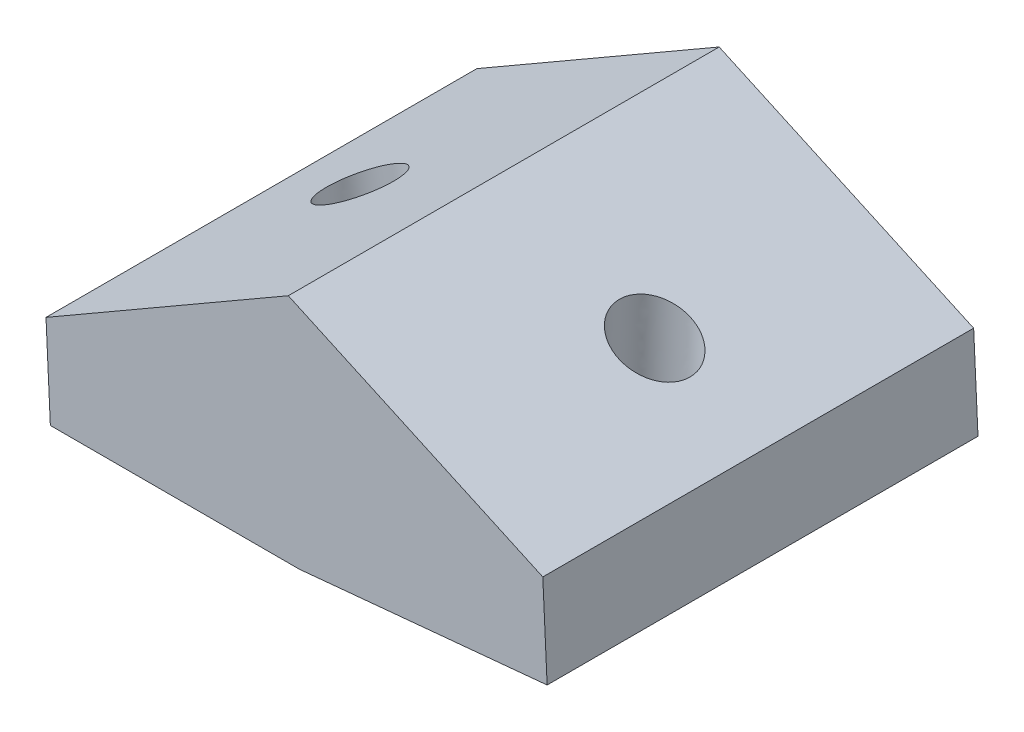
ISO-10303-21;
HEADER;
FILE_DESCRIPTION(('STEP AP214'),'2;1');
FILE_NAME('part.step','',(''),(''),'','','');
FILE_SCHEMA(('AUTOMOTIVE_DESIGN { 1 0 10303 214 1 1 1 1 }'));
ENDSEC;
DATA;
#1=APPLICATION_CONTEXT('core data for automotive mechanical design processes');
#2=APPLICATION_PROTOCOL_DEFINITION('international standard','automotive_design',2000,#1);
#3=PRODUCT_CONTEXT('',#1,'mechanical');
#4=PRODUCT('Part','Part','',(#3));
#5=PRODUCT_RELATED_PRODUCT_CATEGORY('part','',(#4));
#6=PRODUCT_DEFINITION_FORMATION('','',#4);
#7=PRODUCT_DEFINITION_CONTEXT('part definition',#1,'design');
#8=PRODUCT_DEFINITION('design','',#6,#7);
#9=PRODUCT_DEFINITION_SHAPE('','',#8);
#10=(LENGTH_UNIT() NAMED_UNIT(*) SI_UNIT(.MILLI.,.METRE.));
#11=(NAMED_UNIT(*) PLANE_ANGLE_UNIT() SI_UNIT($,.RADIAN.));
#12=(NAMED_UNIT(*) SI_UNIT($,.STERADIAN.) SOLID_ANGLE_UNIT());
#13=UNCERTAINTY_MEASURE_WITH_UNIT(LENGTH_MEASURE(1.E-05),#10,'distance_accuracy_value','');
#14=(GEOMETRIC_REPRESENTATION_CONTEXT(3) GLOBAL_UNCERTAINTY_ASSIGNED_CONTEXT((#13)) GLOBAL_UNIT_ASSIGNED_CONTEXT((#10,
#11,#12)) REPRESENTATION_CONTEXT('',''));
#15=CARTESIAN_POINT('',(0.,0.,0.));
#16=DIRECTION('',(0.,0.,1.));
#17=DIRECTION('',(1.,0.,0.));
#18=AXIS2_PLACEMENT_3D('',#15,#16,#17);
#19=CARTESIAN_POINT('',(10.8020588900131,0.,7.5));
#20=DIRECTION('',(-0.0948474515750241,0.995491818615162,0.));
#21=DIRECTION('',(0.995491818615162,0.0948474515750241,0.));
#22=AXIS2_PLACEMENT_3D('',#19,#20,#21);
#23=PLANE('',#22);
#24=DIRECTION('',(-0.995491818615162,-0.0948474515750241,0.));
#25=VECTOR('',#24,1.);
#26=CARTESIAN_POINT('',(10.8020588900131,0.,-7.5));
#27=LINE('',#26,#25);
#28=CARTESIAN_POINT('',(19.4300978514167,0.822053473746841,-7.5));
#29=VERTEX_POINT('',#28);
#30=CARTESIAN_POINT('',(10.8020588900131,0.,-7.5));
#31=VERTEX_POINT('',#30);
#32=EDGE_CURVE('E117',#29,#31,#27,.T.);
#33=ORIENTED_EDGE('',*,*,#32,.F.);
#34=DIRECTION('',(0.,0.,-1.));
#35=VECTOR('',#34,1.);
#36=CARTESIAN_POINT('',(19.4300978514167,0.822053473746841,7.5));
#37=LINE('',#36,#35);
#38=CARTESIAN_POINT('',(19.4300978514167,0.822053473746841,7.5));
#39=VERTEX_POINT('',#38);
#40=EDGE_CURVE('E114',#39,#29,#37,.T.);
#41=ORIENTED_EDGE('',*,*,#40,.F.);
#42=DIRECTION('',(-0.995491818615162,-0.0948474515750241,0.));
#43=VECTOR('',#42,1.);
#44=CARTESIAN_POINT('',(10.8020588900131,0.,7.5));
#45=LINE('',#44,#43);
#46=CARTESIAN_POINT('',(10.8020588900131,0.,7.5));
#47=VERTEX_POINT('',#46);
#48=EDGE_CURVE('E103',#39,#47,#45,.T.);
#49=ORIENTED_EDGE('',*,*,#48,.T.);
#50=DIRECTION('',(0.,0.,-1.));
#51=VECTOR('',#50,1.);
#52=CARTESIAN_POINT('',(10.8020588900131,0.,7.5));
#53=LINE('',#52,#51);
#54=EDGE_CURVE('E122',#47,#31,#53,.T.);
#55=ORIENTED_EDGE('',*,*,#54,.T.);
#56=EDGE_LOOP('',(#33,#41,#49,#55));
#57=FACE_BOUND('',#56,.T.);
#58=CARTESIAN_POINT('',(16.7875875573436,0.570283079990845,0.));
#59=CARTESIAN_POINT('',(16.7875841901683,0.570282759176561,0.0692360491479163));
#60=CARTESIAN_POINT('',(16.7818400239026,0.569735472376684,0.138544782789783));
#61=CARTESIAN_POINT('',(16.7590138023736,0.567560658982313,0.275212517791107));
#62=CARTESIAN_POINT('',(16.7419317470996,0.565933132386801,0.342571519148725));
#63=CARTESIAN_POINT('',(16.6969048413712,0.561643104904118,0.473531081509184));
#64=CARTESIAN_POINT('',(16.6689599936231,0.558980604274796,0.537131643448385));
#65=CARTESIAN_POINT('',(16.6029772123912,0.552693964313879,0.658806955690446));
#66=CARTESIAN_POINT('',(16.564939283079,0.549069825379733,0.716881708277134));
#67=CARTESIAN_POINT('',(16.4798197703239,0.540959895480591,0.825907151696606));
#68=CARTESIAN_POINT('',(16.4327381912016,0.53647410492725,0.87685784593289));
#69=CARTESIAN_POINT('',(16.3308298859243,0.526764589621214,0.970228943636753));
#70=CARTESIAN_POINT('',(16.2760031635632,0.521540865229998,1.01264935128288));
#71=CARTESIAN_POINT('',(16.1601167928557,0.510499562098859,1.08779012674263));
#72=CARTESIAN_POINT('',(16.0990571473033,0.504681983625151,1.12051049890459));
#73=CARTESIAN_POINT('',(15.972389032783,0.492613428531671,1.17534867469817));
#74=CARTESIAN_POINT('',(15.9067805654417,0.48636245206688,1.19746648212122));
#75=CARTESIAN_POINT('',(15.7728243742607,0.473599511057598,1.23048951778948));
#76=CARTESIAN_POINT('',(15.7044766510448,0.467087546572541,1.24139474858814));
#77=CARTESIAN_POINT('',(15.5669270615564,0.453982237433678,1.2516918517793));
#78=CARTESIAN_POINT('',(15.4977251953463,0.447388892785806,1.25108372501129));
#79=CARTESIAN_POINT('',(15.3603759966638,0.434302676277244,1.23837088949855));
#80=CARTESIAN_POINT('',(15.292228664191,0.42780980441651,1.22626618075888));
#81=CARTESIAN_POINT('',(15.1588681284247,0.415103615654749,1.19089404721108));
#82=CARTESIAN_POINT('',(15.0936549251269,0.408890298753294,1.16762662242005));
#83=CARTESIAN_POINT('',(14.9679613141291,0.396914591409971,1.11057080716511));
#84=CARTESIAN_POINT('',(14.9074809064175,0.391152200966998,1.07678241672704));
#85=CARTESIAN_POINT('',(14.7929210136825,0.380237280647775,0.999616602972571));
#86=CARTESIAN_POINT('',(14.7388415286391,0.375084750769629,0.956239179685995));
#87=CARTESIAN_POINT('',(14.6385750598674,0.365531664683342,0.86109171024252));
#88=CARTESIAN_POINT('',(14.592388076112,0.361131108472625,0.809321664114347));
#89=CARTESIAN_POINT('',(14.5091805010583,0.353203342218792,0.698816836353949));
#90=CARTESIAN_POINT('',(14.472159909729,0.349676132172738,0.640082054745135));
#91=CARTESIAN_POINT('',(14.4083061888086,0.343592342643144,0.517267736960835));
#92=CARTESIAN_POINT('',(14.3814730591875,0.341035763156758,0.453188200801018));
#93=CARTESIAN_POINT('',(14.3387343481353,0.336963747946675,0.321451767099553));
#94=CARTESIAN_POINT('',(14.3228287666802,0.335448312220708,0.253794869565706));
#95=CARTESIAN_POINT('',(14.3023838443919,0.333500381820451,0.116769772117538));
#96=CARTESIAN_POINT('',(14.2978445035451,0.333067887144872,0.0474015722052541));
#97=CARTESIAN_POINT('',(14.3002572621115,0.333297767488461,-0.0911328723644458));
#98=CARTESIAN_POINT('',(14.307209361524,0.333960142507553,-0.160299117021876));
#99=CARTESIAN_POINT('',(14.3324132545731,0.336361493257765,-0.296521963484224));
#100=CARTESIAN_POINT('',(14.3506650482216,0.338100468990026,-0.36357856528691));
#101=CARTESIAN_POINT('',(14.397964926209,0.342607058399417,-0.493732623558328));
#102=CARTESIAN_POINT('',(14.4270130105701,0.345374672078678,-0.556830080018865));
#103=CARTESIAN_POINT('',(14.495104292434,0.351862203606815,-0.677325540871182));
#104=CARTESIAN_POINT('',(14.5341474899653,0.355582121458409,-0.734723545246687));
#105=CARTESIAN_POINT('',(14.6211521427221,0.363871661799012,-0.842236990429838));
#106=CARTESIAN_POINT('',(14.6691135979773,0.368441284290848,-0.892352431213248));
#107=CARTESIAN_POINT('',(14.7726319324813,0.37830419831525,-0.983918497506395));
#108=CARTESIAN_POINT('',(14.8281888117563,0.383597489850302,-1.02536912298636));
#109=CARTESIAN_POINT('',(14.9453656667132,0.394761746420186,-1.09846229197647));
#110=CARTESIAN_POINT('',(15.0069856424145,0.400632711456847,-1.13010483545555));
#111=CARTESIAN_POINT('',(15.1345891318018,0.412790386240468,-1.18270909288411));
#112=CARTESIAN_POINT('',(15.2005726454991,0.419077095988489,-1.20367080680633));
#113=CARTESIAN_POINT('',(15.335083297857,0.431892864382843,-1.23433524955401));
#114=CARTESIAN_POINT('',(15.4036104365219,0.438421923029577,-1.24403797836082));
#115=CARTESIAN_POINT('',(15.5413182674685,0.451542308936294,-1.25191683494976));
#116=CARTESIAN_POINT('',(15.6104989597507,0.458133636196312,-1.25009296272521));
#117=CARTESIAN_POINT('',(15.7476058005841,0.471196761581545,-1.23496892188796));
#118=CARTESIAN_POINT('',(15.815531949136,0.477668559706828,-1.22166875328169));
#119=CARTESIAN_POINT('',(15.9482562067302,0.490314125807526,-1.18395896049838));
#120=CARTESIAN_POINT('',(16.0130543157776,0.49648789378343,-1.15954933633955));
#121=CARTESIAN_POINT('',(16.1377352808086,0.50836711927979,-1.10029387881339));
#122=CARTESIAN_POINT('',(16.1976181368045,0.514072576801435,-1.06544804547256));
#123=CARTESIAN_POINT('',(16.3108169361542,0.524857816256841,-0.986281295689631));
#124=CARTESIAN_POINT('',(16.3641328795287,0.529937598192579,-0.94196037927747));
#125=CARTESIAN_POINT('',(16.4627273871135,0.539331384870532,-0.845065792742752));
#126=CARTESIAN_POINT('',(16.5080059513515,0.543645389615377,-0.792492122648538));
#127=CARTESIAN_POINT('',(16.5892766695937,0.551388618006408,-0.680542466029374));
#128=CARTESIAN_POINT('',(16.6252688236288,0.554817841655543,-0.621166479527096));
#129=CARTESIAN_POINT('',(16.6869747473346,0.560696995558302,-0.497248418403952));
#130=CARTESIAN_POINT('',(16.7126885170349,0.563146925814733,-0.432706343797894));
#131=CARTESIAN_POINT('',(16.7508017897948,0.566778243244851,-0.30785443337027));
#132=CARTESIAN_POINT('',(16.7643919319801,0.568073070915674,-0.247910832774351));
#133=CARTESIAN_POINT('',(16.7781985162917,0.569388520538076,-0.156424994979649));
#134=CARTESIAN_POINT('',(16.7817050699986,0.569722614376607,-0.125354151458909));
#135=CARTESIAN_POINT('',(16.7864069738737,0.570170597566183,-0.0628611958610838));
#136=CARTESIAN_POINT('',(16.7875890862807,0.570283225663349,-0.031438090996463));
#137=CARTESIAN_POINT('',(16.7875875573436,0.570283079990845,0.));
#138=B_SPLINE_CURVE_WITH_KNOTS('',3,(#58,#59,#60,#61,#62,#63,#64,#65,#66,#67,#68,#69,#70,#71,
#72,#73,#74,#75,#76,#77,#78,#79,#80,#81,#82,#83,#84,#85,#86,#87,#88,#89,#90,#91,#92,#93,#94,#95,
#96,#97,#98,#99,#100,#101,#102,#103,#104,#105,#106,#107,#108,#109,#110,#111,#112,#113,#114,#115,
#116,#117,#118,#119,#120,#121,#122,#123,#124,#125,#126,#127,#128,#129,#130,#131,#132,#133,#134,
#135,#136,#137),.UNSPECIFIED.,.T.,.F.,(4,2,2,2,2,2,2,2,2,2,2,2,2,2,2,2,2,2,2,2,2,2,2,2,2,2,2,2,
2,2,2,2,2,2,2,2,2,2,2,4),(0.,0.207595609090906,0.41519121837749,0.622786775944459,
0.830382247711448,1.03797762029992,1.24557289119783,1.45316806903482,1.66076317263668,
1.86835822896272,2.07595327015199,2.28354831124969,2.49114335202933,2.69873839229924,
2.90633343192364,3.11392847083744,3.32152350905342,3.52911854666081,3.73671358381553,
3.94430862072309,4.15190365761608,4.35949869472869,4.56709373227103,4.77468877040615,
4.98228380923215,5.18987884877141,5.3974738889682,5.60506892969472,5.81266397076514,
6.02025901195595,6.22785405303044,6.43544909376466,6.64304413397193,6.85063917352332,
7.05823421236174,7.26582925050823,7.47342428805964,7.65715815108703,7.75088905193434,
7.84515222450687),.UNSPECIFIED.);
#139=CARTESIAN_POINT('',(16.7875875573436,0.570283079990845,0.));
#140=VERTEX_POINT('',#139);
#141=EDGE_CURVE('E160',#140,#140,#138,.T.);
#142=ORIENTED_EDGE('',*,*,#141,.F.);
#143=EDGE_LOOP('',(#142));
#144=FACE_BOUND('',#143,.T.);
#145=ADVANCED_FACE('F38',(#57,#144),#23,.F.);
#146=CARTESIAN_POINT('',(19.2788770286056,4.0054824990962,7.5));
#147=DIRECTION('',(-0.415605606759396,-0.909544929967813,0.));
#148=DIRECTION('',(-0.909544929967813,0.415605606759396,0.));
#149=AXIS2_PLACEMENT_3D('',#146,#147,#148);
#150=PLANE('',#149);
#151=DIRECTION('',(0.909544929967813,-0.415605606759396,0.));
#152=VECTOR('',#151,1.);
#153=CARTESIAN_POINT('',(19.2788770286056,4.0054824990962,-7.5));
#154=LINE('',#153,#152);
#155=CARTESIAN_POINT('',(10.4192557731961,8.05377978073046,-7.5));
#156=VERTEX_POINT('',#155);
#157=CARTESIAN_POINT('',(19.2788770286056,4.0054824990962,-7.5));
#158=VERTEX_POINT('',#157);
#159=EDGE_CURVE('E127',#156,#158,#154,.T.);
#160=ORIENTED_EDGE('',*,*,#159,.F.);
#161=DIRECTION('',(0.,0.,-1.));
#162=VECTOR('',#161,1.);
#163=CARTESIAN_POINT('',(10.4192557731961,8.05377978073046,7.5));
#164=LINE('',#163,#162);
#165=CARTESIAN_POINT('',(10.4192557731961,8.05377978073046,7.5));
#166=VERTEX_POINT('',#165);
#167=EDGE_CURVE('E76',#166,#156,#164,.T.);
#168=ORIENTED_EDGE('',*,*,#167,.F.);
#169=DIRECTION('',(0.909544929967813,-0.415605606759396,0.));
#170=VECTOR('',#169,1.);
#171=CARTESIAN_POINT('',(19.2788770286056,4.0054824990962,7.5));
#172=LINE('',#171,#170);
#173=CARTESIAN_POINT('',(19.2788770286056,4.0054824990962,7.5));
#174=VERTEX_POINT('',#173);
#175=EDGE_CURVE('E111',#166,#174,#172,.T.);
#176=ORIENTED_EDGE('',*,*,#175,.T.);
#177=DIRECTION('',(0.,0.,-1.));
#178=VECTOR('',#177,1.);
#179=CARTESIAN_POINT('',(19.2788770286056,4.0054824990962,7.5));
#180=LINE('',#179,#178);
#181=EDGE_CURVE('E126',#174,#158,#180,.T.);
#182=ORIENTED_EDGE('',*,*,#181,.T.);
#183=EDGE_LOOP('',(#160,#168,#176,#182));
#184=FACE_BOUND('',#183,.T.);
#185=CARTESIAN_POINT('',(16.9016362744901,5.09173404475905,0.));
#186=CARTESIAN_POINT('',(16.9016386731244,5.09173294873199,-0.032620065091739));
#187=CARTESIAN_POINT('',(16.9003852708628,5.09230567580712,-0.0652249095849663));
#188=CARTESIAN_POINT('',(16.8929210129643,5.09571637859999,-0.162058237227129));
#189=CARTESIAN_POINT('',(16.8830583629761,5.10022299778664,-0.225999536111652));
#190=CARTESIAN_POINT('',(16.8537078705563,5.11363435198048,-0.352026528897011));
#191=CARTESIAN_POINT('',(16.8340909179892,5.12259808230994,-0.414075147802492));
#192=CARTESIAN_POINT('',(16.7859015228404,5.14461764632432,-0.53384624307555));
#193=CARTESIAN_POINT('',(16.7573283571273,5.15767381043543,-0.591568369652376));
#194=CARTESIAN_POINT('',(16.7082848265894,5.18008366133552,-0.67426057479675));
#195=CARTESIAN_POINT('',(16.6907360626679,5.18810235776028,-0.701382247882807));
#196=CARTESIAN_POINT('',(16.653744532546,5.2050051921505,-0.754004700539054));
#197=CARTESIAN_POINT('',(16.6343023292937,5.21388907288365,-0.779505958179622));
#198=CARTESIAN_POINT('',(16.5728915702689,5.24194997996462,-0.853942448460372));
#199=CARTESIAN_POINT('',(16.5281983255838,5.26237202011189,-0.900207929121391));
#200=CARTESIAN_POINT('',(16.4329271485386,5.30590503760012,-0.98475680020761));
#201=CARTESIAN_POINT('',(16.382345047264,5.32901791987644,-1.02303448161615));
#202=CARTESIAN_POINT('',(16.3007109203068,5.36631965148798,-1.07552705889407));
#203=CARTESIAN_POINT('',(16.2712353620226,5.37978815302283,-1.09276978462853));
#204=CARTESIAN_POINT('',(16.211167667793,5.40723536281358,-1.12462731830782));
#205=CARTESIAN_POINT('',(16.1805765977824,5.42121358400342,-1.13924455978831));
#206=CARTESIAN_POINT('',(16.0873817271706,5.46379785826114,-1.17909650466865));
#207=CARTESIAN_POINT('',(16.0233281138701,5.49306638578931,-1.20034940083551));
#208=CARTESIAN_POINT('',(15.8930712280545,5.55258570174647,-1.23188886326117));
#209=CARTESIAN_POINT('',(15.8268681787834,5.58283638816676,-1.24217656465289));
#210=CARTESIAN_POINT('',(15.6938049745336,5.64363801755033,-1.25168768497729));
#211=CARTESIAN_POINT('',(15.6269448451067,5.67418894883799,-1.25091153246143));
#212=CARTESIAN_POINT('',(15.4940900720922,5.73489533807765,-1.23829967470818));
#213=CARTESIAN_POINT('',(15.4280954512425,5.7650507856398,-1.22646367950281));
#214=CARTESIAN_POINT('',(15.2985016193012,5.82426712711088,-1.19187098860696));
#215=CARTESIAN_POINT('',(15.2349026269515,5.85332792106826,-1.16911329826347));
#216=CARTESIAN_POINT('',(15.1116831194924,5.90963159170052,-1.11297172554034));
#217=CARTESIAN_POINT('',(15.0520632227046,5.93687418584073,-1.07958619630295));
#218=CARTESIAN_POINT('',(14.9384469201667,5.98878978758647,-1.00269634053936));
#219=CARTESIAN_POINT('',(14.8844517264689,6.01346224135924,-0.95918983957512));
#220=CARTESIAN_POINT('',(14.7851347014215,6.05884396038859,-0.864151895551817));
#221=CARTESIAN_POINT('',(14.739620646985,6.07964105967081,-0.812864194408255));
#222=CARTESIAN_POINT('',(14.6585794389163,6.11667186413377,-0.704564659765025));
#223=CARTESIAN_POINT('',(14.6227523059135,6.13304264127679,-0.64782457478947));
#224=CARTESIAN_POINT('',(14.5612379927757,6.16115086616339,-0.530310352112376));
#225=CARTESIAN_POINT('',(14.5352730159101,6.17301524977897,-0.46971378959307));
#226=CARTESIAN_POINT('',(14.5037894455752,6.1874012882481,-0.376661216173651));
#227=CARTESIAN_POINT('',(14.4946041854788,6.19159838227812,-0.345656373396234));
#228=CARTESIAN_POINT('',(14.4785950609378,6.19891355902128,-0.282885357862958));
#229=CARTESIAN_POINT('',(14.4717734881074,6.20203059460887,-0.251118478024301));
#230=CARTESIAN_POINT('',(14.4549751330765,6.20970640072376,-0.154978956552871));
#231=CARTESIAN_POINT('',(14.4486704213401,6.21258726285631,-0.0897842658630503));
#232=CARTESIAN_POINT('',(14.4461597623463,6.21373447826053,0.0408269050711535));
#233=CARTESIAN_POINT('',(14.4499515499021,6.21200186658197,0.106243332279435));
#234=CARTESIAN_POINT('',(14.4629955716539,6.20604155786481,0.202605784035248));
#235=CARTESIAN_POINT('',(14.4685042581589,6.20352442987923,0.234211616626185));
#236=CARTESIAN_POINT('',(14.4818646160163,6.19741957518666,0.296814443716175));
#237=CARTESIAN_POINT('',(14.4897159596372,6.19383199823262,0.327811522732169));
#238=CARTESIAN_POINT('',(14.5169188137089,6.18140198152909,0.420372585398348));
#239=CARTESIAN_POINT('',(14.5398118145072,6.17094130039725,0.480720274929863));
#240=CARTESIAN_POINT('',(14.5941302359713,6.14612115158806,0.59658691726984));
#241=CARTESIAN_POINT('',(14.6255594098967,6.13175996890395,0.652103731785474));
#242=CARTESIAN_POINT('',(14.6788181569905,6.10742402554128,0.731608335062369));
#243=CARTESIAN_POINT('',(14.6979284929337,6.09869178757959,0.757847855540923));
#244=CARTESIAN_POINT('',(14.7379685742778,6.08039595440669,0.808575764876764));
#245=CARTESIAN_POINT('',(14.7588977157897,6.07083263513535,0.833064730077647));
#246=CARTESIAN_POINT('',(14.8246773368092,6.04077542915755,0.904260437703102));
#247=CARTESIAN_POINT('',(14.8721278786942,6.01909347524688,0.948114031320799));
#248=CARTESIAN_POINT('',(14.9725353866583,5.97321347317582,1.02743225109204));
#249=CARTESIAN_POINT('',(15.0254962441793,5.94901364686793,1.06289088995919));
#250=CARTESIAN_POINT('',(15.1105707615332,5.91013987027956,1.11081365172619));
#251=CARTESIAN_POINT('',(15.1412548789885,5.89611913217997,1.12641608172061));
#252=CARTESIAN_POINT('',(15.2036193094617,5.86762245641052,1.15488831870827));
#253=CARTESIAN_POINT('',(15.2352986727975,5.85314695268647,1.16776064502741));
#254=CARTESIAN_POINT('',(15.3315735112231,5.80915532421252,1.20223005659633));
#255=CARTESIAN_POINT('',(15.3974344666571,5.779060953453,1.21969564225633));
#256=CARTESIAN_POINT('',(15.5307696574417,5.7181350430965,1.2433226831192));
#257=CARTESIAN_POINT('',(15.5982437591656,5.68730356455866,1.24948507137087));
#258=CARTESIAN_POINT('',(15.7332661092355,5.62560672707657,1.25045278365269));
#259=CARTESIAN_POINT('',(15.8008143565082,5.59474136862274,1.24525826996502));
#260=CARTESIAN_POINT('',(15.9344005065866,5.53370078543799,1.22356811808031));
#261=CARTESIAN_POINT('',(16.0004383276118,5.50352559807564,1.20707186945281));
#262=CARTESIAN_POINT('',(16.1293971962075,5.44459939546175,1.16298324080198));
#263=CARTESIAN_POINT('',(16.1923178624211,5.41584855446665,1.13538950684424));
#264=CARTESIAN_POINT('',(16.3133724251107,5.36053412928545,1.06949451412502));
#265=CARTESIAN_POINT('',(16.371505418786,5.33397095762332,1.03119124184697));
#266=CARTESIAN_POINT('',(16.4802614238227,5.2842762103131,0.945304262729422));
#267=CARTESIAN_POINT('',(16.5309991370222,5.26109222304088,0.897896795495212));
#268=CARTESIAN_POINT('',(16.6227469707457,5.21916915487001,0.796273816815446));
#269=CARTESIAN_POINT('',(16.6640494316101,5.20029649257196,0.742378363149175));
#270=CARTESIAN_POINT('',(16.7365655227657,5.16716113765815,0.629643835963425));
#271=CARTESIAN_POINT('',(16.7680738886346,5.15276376916819,0.571034511867974));
#272=CARTESIAN_POINT('',(16.8209494482046,5.1286029187321,0.450486484779592));
#273=CARTESIAN_POINT('',(16.8425724460018,5.11872255018365,0.388684248227257));
#274=CARTESIAN_POINT('',(16.8731673183315,5.10474259156991,0.273105169420603));
#275=CARTESIAN_POINT('',(16.8836913860697,5.0999337455044,0.219817784595089));
#276=CARTESIAN_POINT('',(16.8979943484796,5.09339817900847,0.111021016201061));
#277=CARTESIAN_POINT('',(16.901632194284,5.0917359091601,0.0554884870590296));
#278=CARTESIAN_POINT('',(16.9016362744901,5.09173404475905,0.));
#279=B_SPLINE_CURVE_WITH_KNOTS('',3,(#185,#186,#187,#188,#189,#190,#191,#192,#193,#194,#195,
#196,#197,#198,#199,#200,#201,#202,#203,#204,#205,#206,#207,#208,#209,#210,#211,#212,#213,#214,
#215,#216,#217,#218,#219,#220,#221,#222,#223,#224,#225,#226,#227,#228,#229,#230,#231,#232,#233,
#234,#235,#236,#237,#238,#239,#240,#241,#242,#243,#244,#245,#246,#247,#248,#249,#250,#251,#252,
#253,#254,#255,#256,#257,#258,#259,#260,#261,#262,#263,#264,#265,#266,#267,#268,#269,#270,#271,
#272,#273,#274,#275,#276,#277,#278),.UNSPECIFIED.,.T.,.F.,(4,2,2,2,2,2,2,2,2,2,2,2,2,2,2,2,2,2,
2,2,2,2,2,2,2,2,2,2,2,2,2,2,2,2,2,2,2,2,2,2,2,2,2,2,2,2,4),(0.,0.0978185092397404,
0.291391946155556,0.487598637908891,0.683821175621743,0.783584199879793,0.883317653118183,
1.08492172291571,1.28666939278724,1.39669125755627,1.50661061188256,1.72634312704996,
1.94605289297756,2.16575414860784,2.38546116454734,2.605188193289,2.82494928685321,
3.04475763861945,3.25872982637461,3.46501695374032,3.66496413133052,3.76269124733412,
3.8605128472051,4.05620925768473,4.25186176665578,4.34830949577577,4.44474373843608,
4.63996767936109,4.83527759741394,4.93602965169124,5.03674838064018,5.24033425974748,
5.44406490194389,5.55546594892598,5.66676374394798,5.88925418708065,6.11172626339365,
6.33419516075705,6.55667607508073,6.77918414114033,7.00173406944264,7.22034536866383,
7.43079908129202,7.63411294275237,7.8318175301374,7.99490626886139,8.16130081984755),.UNSPECIFIED.);
#280=CARTESIAN_POINT('',(16.9016362744901,5.09173404475905,0.));
#281=VERTEX_POINT('',#280);
#282=EDGE_CURVE('E42',#281,#281,#279,.T.);
#283=ORIENTED_EDGE('',*,*,#282,.F.);
#284=EDGE_LOOP('',(#283));
#285=FACE_BOUND('',#284,.T.);
#286=ADVANCED_FACE('F171',(#184,#285),#150,.F.);
#287=CARTESIAN_POINT('',(10.8020588900131,0.,7.5));
#288=DIRECTION('',(0.,1.,0.));
#289=DIRECTION('',(-1.,0.,0.));
#290=AXIS2_PLACEMENT_3D('',#287,#288,#289);
#291=PLANE('',#290);
#292=DIRECTION('',(1.,0.,0.));
#293=VECTOR('',#292,1.);
#294=CARTESIAN_POINT('',(10.8020588900131,0.,-7.5));
#295=LINE('',#294,#293);
#296=CARTESIAN_POINT('',(2.13494701619964,0.,-7.5));
#297=VERTEX_POINT('',#296);
#298=EDGE_CURVE('E151',#297,#31,#295,.T.);
#299=ORIENTED_EDGE('',*,*,#298,.T.);
#300=ORIENTED_EDGE('',*,*,#54,.F.);
#301=DIRECTION('',(1.,0.,0.));
#302=VECTOR('',#301,1.);
#303=CARTESIAN_POINT('',(10.8020588900131,0.,7.5));
#304=LINE('',#303,#302);
#305=CARTESIAN_POINT('',(2.13494701619964,0.,7.5));
#306=VERTEX_POINT('',#305);
#307=EDGE_CURVE('E86',#306,#47,#304,.T.);
#308=ORIENTED_EDGE('',*,*,#307,.F.);
#309=DIRECTION('',(0.,0.,-1.));
#310=VECTOR('',#309,1.);
#311=CARTESIAN_POINT('',(2.13494701619964,0.,7.5));
#312=LINE('',#311,#310);
#313=EDGE_CURVE('E11',#306,#297,#312,.T.);
#314=ORIENTED_EDGE('',*,*,#313,.T.);
#315=EDGE_LOOP('',(#299,#300,#308,#314));
#316=FACE_BOUND('',#315,.T.);
#317=CARTESIAN_POINT('',(7.28849117271887,0.,0.));
#318=CARTESIAN_POINT('',(7.28848779032285,0.,0.0692360899975336));
#319=CARTESIAN_POINT('',(7.28271760882854,0.,0.138544863359581));
#320=CARTESIAN_POINT('',(7.25978800699613,0.,0.275212678011097));
#321=CARTESIAN_POINT('',(7.24262858663902,0.,0.342571719297308));
#322=CARTESIAN_POINT('',(7.19739775480378,0.,0.473531346869872));
#323=CARTESIAN_POINT('',(7.16932634814312,0.,0.537131934815509));
#324=CARTESIAN_POINT('',(7.10304474649195,0.,0.658807277255484));
#325=CARTESIAN_POINT('',(7.06483455892711,0.,0.71688203579692));
#326=CARTESIAN_POINT('',(6.97932958776923,0.,0.825907469706519));
#327=CARTESIAN_POINT('',(6.93203481186725,0.,0.876858151105915));
#328=CARTESIAN_POINT('',(6.82966505813716,0.,0.970229206790167));
#329=CARTESIAN_POINT('',(6.77459008706266,0.,1.01264958847969));
#330=CARTESIAN_POINT('',(6.65817901525747,0.,1.08779030409415));
#331=CARTESIAN_POINT('',(6.59684291950056,0.,1.12051064572462));
#332=CARTESIAN_POINT('',(6.46960132579979,0.,1.17534876225124));
#333=CARTESIAN_POINT('',(6.40369583075151,0.,1.19746654386606));
#334=CARTESIAN_POINT('',(6.26913319378003,0.,1.23048953839766));
#335=CARTESIAN_POINT('',(6.20047605296728,0.,1.24139475583933));
#336=CARTESIAN_POINT('',(6.06230376488876,0.,1.25169184835546));
#337=CARTESIAN_POINT('',(5.99278861773386,0.,1.25108372491756));
#338=CARTESIAN_POINT('',(5.85481763076115,0.,1.23837091368056));
#339=CARTESIAN_POINT('',(5.78636179094251,0.,1.22626622589043));
#340=CARTESIAN_POINT('',(5.65239752273512,0.,1.19089415278594));
#341=CARTESIAN_POINT('',(5.58688909433836,0.,1.16762676750189));
#342=CARTESIAN_POINT('',(5.46062645630438,0.,1.11057105112867));
#343=CARTESIAN_POINT('',(5.39987224664648,0.,1.07678272008528));
#344=CARTESIAN_POINT('',(5.28479372134862,0.,0.99961704576014));
#345=CARTESIAN_POINT('',(5.23046940567324,0.,0.956239702531219));
#346=CARTESIAN_POINT('',(5.12974899425351,0.,0.861092412989366));
#347=CARTESIAN_POINT('',(5.08335289846107,0.,0.809322466727341));
#348=CARTESIAN_POINT('',(4.99976857883575,0.,0.698817855101747));
#349=CARTESIAN_POINT('',(4.96258035494803,0.,0.640083189779664));
#350=CARTESIAN_POINT('',(4.89843746499852,0.,0.517269114590829));
#351=CARTESIAN_POINT('',(4.87148279888356,0.,0.453189704751842));
#352=CARTESIAN_POINT('',(4.82855045706151,0.,0.321453524477046));
#353=CARTESIAN_POINT('',(4.812572781312,0.,0.253796754055061));
#354=CARTESIAN_POINT('',(4.79203509712751,0.,0.116771900296258));
#355=CARTESIAN_POINT('',(4.78747508866844,0.,0.047403816963051));
#356=CARTESIAN_POINT('',(4.78989850753702,0.,-0.0911304171001497));
#357=CARTESIAN_POINT('',(4.79688193486325,0.,-0.160296567830168));
#358=CARTESIAN_POINT('',(4.82219961700007,0.,-0.296519260456442));
#359=CARTESIAN_POINT('',(4.84053387183194,0.,-0.363575802348742));
#360=CARTESIAN_POINT('',(4.88804753551957,0.,-0.493729783935386));
#361=CARTESIAN_POINT('',(4.91722694441511,0.,-0.556827223615206));
#362=CARTESIAN_POINT('',(4.98562612286724,0.,-0.677322699762438));
#363=CARTESIAN_POINT('',(5.02484589247464,0.,-0.734720736201011));
#364=CARTESIAN_POINT('',(5.11224407379997,0.,-0.842234296120075));
#365=CARTESIAN_POINT('',(5.16042248557073,0.,-0.892349819557619));
#366=CARTESIAN_POINT('',(5.26440914009976,0.,-0.983916099654509));
#367=CARTESIAN_POINT('',(5.32021738290449,0.,-1.0253668562611));
#368=CARTESIAN_POINT('',(5.43792444411307,0.,-1.09846033072585));
#369=CARTESIAN_POINT('',(5.49982326255112,0.,-1.13010304852896));
#370=CARTESIAN_POINT('',(5.62800422902056,0.,-1.18270769051289));
#371=CARTESIAN_POINT('',(5.69428637707176,0.,-1.20366961464542));
#372=CARTESIAN_POINT('',(5.82940585447284,0.,-1.23433450561469));
#373=CARTESIAN_POINT('',(5.8982431838302,0.,-1.24403747241839));
#374=CARTESIAN_POINT('',(6.03657439723484,0.,-1.2519168249773));
#375=CARTESIAN_POINT('',(6.10606828128279,0.,-1.25009321072068));
#376=CARTESIAN_POINT('',(6.2437958683366,0.,-1.23496969890915));
#377=CARTESIAN_POINT('',(6.3120295713437,0.,-1.22166980136563));
#378=CARTESIAN_POINT('',(6.44535481827782,0.,-1.18396055795418));
#379=CARTESIAN_POINT('',(6.51044636221396,0.,-1.15955121211851));
#380=CARTESIAN_POINT('',(6.63569198611448,0.,-1.10029631327803));
#381=CARTESIAN_POINT('',(6.69584606610106,0.,-1.06545076032017));
#382=CARTESIAN_POINT('',(6.80955762560276,0.,-0.986284567923373));
#383=CARTESIAN_POINT('',(6.8631151051548,0.,-0.941963928537478));
#384=CARTESIAN_POINT('',(6.96215634123236,0.,-0.845069886349539));
#385=CARTESIAN_POINT('',(7.00764009780701,0.,-0.792496483597719));
#386=CARTESIAN_POINT('',(7.08927920333316,0.,-0.680547343220448));
#387=CARTESIAN_POINT('',(7.12543455233976,0.,-0.621171605635172));
#388=CARTESIAN_POINT('',(7.18742037745728,0.,-0.497254015394386));
#389=CARTESIAN_POINT('',(7.21325085362064,0.,-0.432712162765117));
#390=CARTESIAN_POINT('',(7.25153759336383,0.,-0.307859569338096));
#391=CARTESIAN_POINT('',(7.26518972564492,0.,-0.247915020940329));
#392=CARTESIAN_POINT('',(7.27905929407433,0.,-0.15642768578664));
#393=CARTESIAN_POINT('',(7.28258184600069,0.,-0.125356314965577));
#394=CARTESIAN_POINT('',(7.28730520255841,0.,-0.0628622868116228));
#395=CARTESIAN_POINT('',(7.288492708593,0.,-0.0314386366065401));
#396=CARTESIAN_POINT('',(7.28849117271887,0.,0.));
#397=B_SPLINE_CURVE_WITH_KNOTS('',3,(#317,#318,#319,#320,#321,#322,#323,#324,#325,#326,#327,
#328,#329,#330,#331,#332,#333,#334,#335,#336,#337,#338,#339,#340,#341,#342,#343,#344,#345,#346,
#347,#348,#349,#350,#351,#352,#353,#354,#355,#356,#357,#358,#359,#360,#361,#362,#363,#364,#365,
#366,#367,#368,#369,#370,#371,#372,#373,#374,#375,#376,#377,#378,#379,#380,#381,#382,#383,#384,
#385,#386,#387,#388,#389,#390,#391,#392,#393,#394,#395,#396),.UNSPECIFIED.,.T.,.F.,(4,2,2,2,2,2,
2,2,2,2,2,2,2,2,2,2,2,2,2,2,2,2,2,2,2,2,2,2,2,2,2,2,2,2,2,2,2,2,2,4),(0.,0.20759572962258,
0.415191459591915,0.622787097911063,0.830382584186739,1.03797789471137,1.24557302503355,
1.45316799044568,1.66076282430836,1.86835757439528,2.07595229765885,2.28354702076015,
2.49114174329783,2.69873646493225,2.90633118542277,3.11392590465407,3.32152062264879,
3.52911533956507,3.73671005567918,3.94430477135531,4.1518994870056,4.35949420304507,
4.56708891984605,4.77468363769746,4.98227835677314,5.18987307711278,5.39746779861759,
5.60506252106113,5.81265724411408,6.02025196738037,6.22784669044056,6.43544141289778,
6.64303613442121,6.85063085478238,7.05822557388013,7.26582029175175,7.47341500856884,
7.65715190431552,7.75088441344267,7.84514922107277),.UNSPECIFIED.);
#398=CARTESIAN_POINT('',(7.28849117271887,0.,0.));
#399=VERTEX_POINT('',#398);
#400=EDGE_CURVE('E131',#399,#399,#397,.T.);
#401=ORIENTED_EDGE('',*,*,#400,.F.);
#402=EDGE_LOOP('',(#401));
#403=FACE_BOUND('',#402,.T.);
#404=ADVANCED_FACE('F203',(#316,#403),#291,.F.);
#405=CARTESIAN_POINT('',(1.98354597778799,3.18342045954603,7.5));
#406=DIRECTION('',(0.5,-0.866025403784439,0.));
#407=DIRECTION('',(0.866025403784439,0.5,0.));
#408=AXIS2_PLACEMENT_3D('',#405,#406,#407);
#409=PLANE('',#408);
#410=DIRECTION('',(-0.866025403784439,-0.5,0.));
#411=VECTOR('',#410,1.);
#412=CARTESIAN_POINT('',(1.98354597778799,3.18342045954603,-7.5));
#413=LINE('',#412,#411);
#414=CARTESIAN_POINT('',(1.98354597778799,3.18342045954603,-7.5));
#415=VERTEX_POINT('',#414);
#416=EDGE_CURVE('E79',#156,#415,#413,.T.);
#417=ORIENTED_EDGE('',*,*,#416,.T.);
#418=DIRECTION('',(0.,0.,-1.));
#419=VECTOR('',#418,1.);
#420=CARTESIAN_POINT('',(1.98354597778799,3.18342045954603,7.5));
#421=LINE('',#420,#419);
#422=CARTESIAN_POINT('',(1.98354597778799,3.18342045954603,7.5));
#423=VERTEX_POINT('',#422);
#424=EDGE_CURVE('E53',#423,#415,#421,.T.);
#425=ORIENTED_EDGE('',*,*,#424,.F.);
#426=DIRECTION('',(-0.866025403784439,-0.5,0.));
#427=VECTOR('',#426,1.);
#428=CARTESIAN_POINT('',(1.98354597778799,3.18342045954603,7.5));
#429=LINE('',#428,#427);
#430=EDGE_CURVE('E62',#166,#423,#429,.T.);
#431=ORIENTED_EDGE('',*,*,#430,.F.);
#432=ORIENTED_EDGE('',*,*,#167,.T.);
#433=EDGE_LOOP('',(#417,#425,#431,#432));
#434=FACE_BOUND('',#433,.T.);
#435=CARTESIAN_POINT('',(6.58330844291149,5.83909455699342,0.));
#436=CARTESIAN_POINT('',(6.58331064272138,5.83909582705426,-0.032619520094919));
#437=CARTESIAN_POINT('',(6.58211727313576,5.83840683480276,-0.0652242927426043));
#438=CARTESIAN_POINT('',(6.57501029420235,5.83430361860249,-0.162057000845643));
#439=CARTESIAN_POINT('',(6.56561958401788,5.82888188954969,-0.225997499068114));
#440=CARTESIAN_POINT('',(6.53767343438728,5.81274717253739,-0.352024133346054));
#441=CARTESIAN_POINT('',(6.5189949134953,5.80196312347198,-0.414073151805046));
#442=CARTESIAN_POINT('',(6.47311148018185,5.77547231089806,-0.533842903991212));
#443=CARTESIAN_POINT('',(6.44590616028037,5.75976531213085,-0.591563430704351));
#444=CARTESIAN_POINT('',(6.39921028707539,5.73280543716514,-0.674253976526508));
#445=CARTESIAN_POINT('',(6.3825013663228,5.72315853727004,-0.701375440117555));
#446=CARTESIAN_POINT('',(6.34728008898429,5.70282352331689,-0.753997631161229));
#447=CARTESIAN_POINT('',(6.32876825962862,5.69213571365537,-0.779498828850254));
#448=CARTESIAN_POINT('',(6.27029630912778,5.65837691729394,-0.85393505018765));
#449=CARTESIAN_POINT('',(6.22774190719683,5.63380812188377,-0.900200371342298));
#450=CARTESIAN_POINT('',(6.13703010154979,5.58143563647471,-0.984749073404));
#451=CARTESIAN_POINT('',(6.08886873232334,5.55362965698733,-1.02302675098885));
#452=CARTESIAN_POINT('',(6.01114104547799,5.50875355606369,-1.07551977093358));
#453=CARTESIAN_POINT('',(5.98307572607186,5.49255003634965,-1.09276281970642));
#454=CARTESIAN_POINT('',(5.92588192055884,5.45952917734071,-1.12462100811572));
#455=CARTESIAN_POINT('',(5.89675444939482,5.44271242402334,-1.13923858127206));
#456=CARTESIAN_POINT('',(5.8080183785339,5.39148062962495,-1.17909154208199));
#457=CARTESIAN_POINT('',(5.74702931550037,5.35626857766495,-1.20034514422251));
#458=CARTESIAN_POINT('',(5.62300431584015,5.28466271072489,-1.23188610691344));
#459=CARTESIAN_POINT('',(5.55996859181536,5.2482690184906,-1.24217460275935));
#460=CARTESIAN_POINT('',(5.4332713790185,5.17512034857675,-1.25168741277704));
#461=CARTESIAN_POINT('',(5.36960991458518,5.13836538494917,-1.25091215559519));
#462=CARTESIAN_POINT('',(5.24311092397068,5.06533115866568,-1.23830217779638));
#463=CARTESIAN_POINT('',(5.18027341943373,5.02905190850607,-1.22646716724361));
#464=CARTESIAN_POINT('',(5.05687903549081,4.95781012772014,-1.19187649760598));
#465=CARTESIAN_POINT('',(4.99632236435415,4.92284771733814,-1.16911984382998));
#466=CARTESIAN_POINT('',(4.87899694650652,4.85510985576102,-1.11298033315974));
#467=CARTESIAN_POINT('',(4.8222287885474,4.82233474448193,-1.07959582928018));
#468=CARTESIAN_POINT('',(4.71404670116207,4.75987578720849,-1.00270792890257));
#469=CARTESIAN_POINT('',(4.66263392587002,4.73019260755382,-0.959202357726539));
#470=CARTESIAN_POINT('',(4.56806652887466,4.67559409544195,-0.86416597599481));
#471=CARTESIAN_POINT('',(4.52472889747256,4.6505731022859,-0.812878896588648));
#472=CARTESIAN_POINT('',(4.44756290347464,4.60602129487893,-0.704580609777193));
#473=CARTESIAN_POINT('',(4.41344887310409,4.58632555026136,-0.647841202292321));
#474=CARTESIAN_POINT('',(4.35487571662688,4.55250832260196,-0.530328370781825));
#475=CARTESIAN_POINT('',(4.33015204507431,4.53823410417572,-0.469732557899913));
#476=CARTESIAN_POINT('',(4.30017330484825,4.52092587043628,-0.376681065442381));
#477=CARTESIAN_POINT('',(4.29142702824723,4.51587620528631,-0.345676643218732));
#478=CARTESIAN_POINT('',(4.27618285455185,4.50707497749972,-0.282906418932845));
#479=CARTESIAN_POINT('',(4.26968713940106,4.50332467460882,-0.251139909737612));
#480=CARTESIAN_POINT('',(4.25369093130549,4.49408925955881,-0.155001616641016));
#481=CARTESIAN_POINT('',(4.24768674833755,4.49062274290602,-0.0898077091079397));
#482=CARTESIAN_POINT('',(4.24529386002018,4.48924120819186,0.0408021275869523));
#483=CARTESIAN_POINT('',(4.248902997679,4.49132494479072,0.106218003655207));
#484=CARTESIAN_POINT('',(4.26132103625611,4.49849450270602,0.202579784691381));
#485=CARTESIAN_POINT('',(4.26656552275389,4.50152240839727,0.234185407657093));
#486=CARTESIAN_POINT('',(4.27928536378149,4.5088662120386,0.296787874402675));
#487=CARTESIAN_POINT('',(4.28676040624401,4.51318192981654,0.327784802696217));
#488=CARTESIAN_POINT('',(4.31265974045256,4.52813491739374,0.420345495273406));
#489=CARTESIAN_POINT('',(4.33445605754768,4.54071902693612,0.48069305806795));
#490=CARTESIAN_POINT('',(4.38617283989372,4.57057772514478,0.596559703178559));
#491=CARTESIAN_POINT('',(4.41609687913919,4.58785437725779,0.652076647118187));
#492=CARTESIAN_POINT('',(4.46680535196274,4.61713092769301,0.731581711382315));
#493=CARTESIAN_POINT('',(4.48500066175356,4.62763599469907,0.757821459843072));
#494=CARTESIAN_POINT('',(4.5231236441786,4.64964630886474,0.808549892227843));
#495=CARTESIAN_POINT('',(4.54305074175019,4.66115122401179,0.833039152538494));
#496=CARTESIAN_POINT('',(4.60568104765143,4.69731084798316,0.904235844335642));
#497=CARTESIAN_POINT('',(4.6508599228814,4.72339488375895,0.948090239546112));
#498=CARTESIAN_POINT('',(4.74646068591655,4.77859001003205,1.02741039447953));
#499=CARTESIAN_POINT('',(4.79688627929489,4.80770323994304,1.0628701666851));
#500=CARTESIAN_POINT('',(4.87788875742624,4.8544700424972,1.1107951811237));
#501=CARTESIAN_POINT('',(4.90710448015518,4.87133774787934,1.12639856921801));
#502=CARTESIAN_POINT('',(4.96648451543125,4.90562082723048,1.15487276135322));
#503=CARTESIAN_POINT('',(4.9966479236883,4.92303567910737,1.16774608466348));
#504=CARTESIAN_POINT('',(5.08831581022857,4.97596015807744,1.2022185495886));
#505=CARTESIAN_POINT('',(5.15102530835532,5.01216550370166,1.21968625555402));
#506=CARTESIAN_POINT('',(5.27798066129428,5.08546321089603,1.24331771006183));
#507=CARTESIAN_POINT('',(5.34222638881786,5.12255549897606,1.24948239188294));
#508=CARTESIAN_POINT('',(5.47078875387498,5.19678101504944,1.25045485221067));
#509=CARTESIAN_POINT('',(5.53510539038102,5.23391424244956,1.24526279317376));
#510=CARTESIAN_POINT('',(5.66230094785963,5.30735063179956,1.22357767178457));
#511=CARTESIAN_POINT('',(5.72517979099831,5.34365374881202,1.20708399911737));
#512=CARTESIAN_POINT('',(5.84797024656243,5.4145468513859,1.16300056842918));
#513=CARTESIAN_POINT('',(5.9078814959368,5.44913662733967,1.13540945651084));
#514=CARTESIAN_POINT('',(6.02314670761703,5.51568502833146,1.06951965472192));
#515=CARTESIAN_POINT('',(6.078499810375,5.54764315710927,1.03121895125932));
#516=CARTESIAN_POINT('',(6.18205645669589,5.60743161473903,0.945336287265521));
#517=CARTESIAN_POINT('',(6.23036912813875,5.63532494860185,0.897930444907903));
#518=CARTESIAN_POINT('',(6.31773213107995,5.68576400186717,0.796310495693361));
#519=CARTESIAN_POINT('',(6.35706085206396,5.70847044951418,0.742416513919854));
#520=CARTESIAN_POINT('',(6.42611205654837,5.74833718101111,0.62968441513236));
#521=CARTESIAN_POINT('',(6.45611521606371,5.7656595132338,0.571076114371783));
#522=CARTESIAN_POINT('',(6.50646545007256,5.79472923439256,0.450531009095993));
#523=CARTESIAN_POINT('',(6.52705613742664,5.80661727327925,0.388730684025968));
#524=CARTESIAN_POINT('',(6.55633176155058,5.82351956274788,0.272595103523605));
#525=CARTESIAN_POINT('',(6.56642721571506,5.82934817592732,0.218727643093844));
#526=CARTESIAN_POINT('',(6.57991131561801,5.83713322463605,0.109892309557684));
#527=CARTESIAN_POINT('',(6.58330473883783,5.83909241844549,0.0549252485460208));
#528=CARTESIAN_POINT('',(6.58330844291149,5.83909455699342,0.));
#529=B_SPLINE_CURVE_WITH_KNOTS('',3,(#435,#436,#437,#438,#439,#440,#441,#442,#443,#444,#445,
#446,#447,#448,#449,#450,#451,#452,#453,#454,#455,#456,#457,#458,#459,#460,#461,#462,#463,#464,
#465,#466,#467,#468,#469,#470,#471,#472,#473,#474,#475,#476,#477,#478,#479,#480,#481,#482,#483,
#484,#485,#486,#487,#488,#489,#490,#491,#492,#493,#494,#495,#496,#497,#498,#499,#500,#501,#502,
#503,#504,#505,#506,#507,#508,#509,#510,#511,#512,#513,#514,#515,#516,#517,#518,#519,#520,#521,
#522,#523,#524,#525,#526,#527,#528),.UNSPECIFIED.,.T.,.F.,(4,2,2,2,2,2,2,2,2,2,2,2,2,2,2,2,2,2,
2,2,2,2,2,2,2,2,2,2,2,2,2,2,2,2,2,2,2,2,2,2,2,2,2,2,2,2,4),(0.,0.0978177330584802,
0.291389196699569,0.487597100445954,0.683814382036244,0.783576537618784,0.883309606541458,
1.08491241519816,1.2866586830592,1.39668129479898,1.5066013957151,1.72633540027839,
1.94604665200565,2.16574939141576,2.38545789058175,2.60518640354776,2.82494898417021,
3.04475882808571,3.25873285126916,3.46502055745344,3.66496726178415,3.76269372491553,
3.86051467150579,4.05620917200421,4.25185976718836,4.3483064735754,4.44473969284762,
4.63996154802121,4.83526938726175,4.93602058549493,5.03673845489073,5.24032253132193,
5.44405138080158,5.55545289971773,5.66675116704459,5.88924254991786,6.11171556108641,
6.33418538983292,6.5566672334439,6.77917622827249,7.0017270868778,7.22034212844326,
7.43079814755333,7.63411298843558,7.83181735320696,7.99664188946327,8.16134888959104),.UNSPECIFIED.);
#530=CARTESIAN_POINT('',(6.58330844291149,5.83909455699342,0.));
#531=VERTEX_POINT('',#530);
#532=EDGE_CURVE('E154',#531,#531,#529,.T.);
#533=ORIENTED_EDGE('',*,*,#532,.F.);
#534=EDGE_LOOP('',(#533));
#535=FACE_BOUND('',#534,.T.);
#536=ADVANCED_FACE('F161',(#434,#535),#409,.F.);
#537=CARTESIAN_POINT('',(2.13494701619964,0.,7.5));
#538=DIRECTION('',(0.99887097456288,0.0475055383697688,0.));
#539=DIRECTION('',(-0.0475055383697688,0.99887097456288,0.));
#540=AXIS2_PLACEMENT_3D('',#537,#538,#539);
#541=PLANE('',#540);
#542=DIRECTION('',(0.0475055383697688,-0.99887097456288,0.));
#543=VECTOR('',#542,1.);
#544=CARTESIAN_POINT('',(2.13494701619964,0.,-7.5));
#545=LINE('',#544,#543);
#546=EDGE_CURVE('E121',#415,#297,#545,.T.);
#547=ORIENTED_EDGE('',*,*,#546,.T.);
#548=ORIENTED_EDGE('',*,*,#313,.F.);
#549=DIRECTION('',(0.0475055383697688,-0.99887097456288,0.));
#550=VECTOR('',#549,1.);
#551=CARTESIAN_POINT('',(2.13494701619964,0.,7.5));
#552=LINE('',#551,#550);
#553=EDGE_CURVE('E145',#423,#306,#552,.T.);
#554=ORIENTED_EDGE('',*,*,#553,.F.);
#555=ORIENTED_EDGE('',*,*,#424,.T.);
#556=EDGE_LOOP('',(#547,#548,#554,#555));
#557=FACE_BOUND('',#556,.T.);
#558=ADVANCED_FACE('F40',(#557),#541,.F.);
#559=CARTESIAN_POINT('',(0.,0.,7.5));
#560=DIRECTION('',(0.,0.,1.));
#561=DIRECTION('',(1.,0.,0.));
#562=AXIS2_PLACEMENT_3D('',#559,#560,#561);
#563=PLANE('',#562);
#564=ORIENTED_EDGE('',*,*,#553,.T.);
#565=ORIENTED_EDGE('',*,*,#307,.T.);
#566=ORIENTED_EDGE('',*,*,#48,.F.);
#567=DIRECTION('',(0.0474489916035366,-0.998873662279574,0.));
#568=VECTOR('',#567,1.);
#569=CARTESIAN_POINT('',(19.4300978514167,0.822053473746841,7.5));
#570=LINE('',#569,#568);
#571=EDGE_CURVE('E107',#174,#39,#570,.T.);
#572=ORIENTED_EDGE('',*,*,#571,.F.);
#573=ORIENTED_EDGE('',*,*,#175,.F.);
#574=ORIENTED_EDGE('',*,*,#430,.T.);
#575=EDGE_LOOP('',(#564,#565,#566,#572,#573,#574));
#576=FACE_BOUND('',#575,.T.);
#577=ADVANCED_FACE('F105',(#576),#563,.T.);
#578=CARTESIAN_POINT('',(0.,0.,-7.5));
#579=DIRECTION('',(0.,0.,1.));
#580=DIRECTION('',(1.,0.,0.));
#581=AXIS2_PLACEMENT_3D('',#578,#579,#580);
#582=PLANE('',#581);
#583=ORIENTED_EDGE('',*,*,#546,.F.);
#584=ORIENTED_EDGE('',*,*,#416,.F.);
#585=ORIENTED_EDGE('',*,*,#159,.T.);
#586=DIRECTION('',(0.0474489916035366,-0.998873662279574,0.));
#587=VECTOR('',#586,1.);
#588=CARTESIAN_POINT('',(19.4300978514167,0.822053473746841,-7.5));
#589=LINE('',#588,#587);
#590=EDGE_CURVE('E139',#158,#29,#589,.T.);
#591=ORIENTED_EDGE('',*,*,#590,.T.);
#592=ORIENTED_EDGE('',*,*,#32,.T.);
#593=ORIENTED_EDGE('',*,*,#298,.F.);
#594=EDGE_LOOP('',(#583,#584,#585,#591,#592,#593));
#595=FACE_BOUND('',#594,.T.);
#596=ADVANCED_FACE('F187',(#595),#582,.F.);
#597=CARTESIAN_POINT('',(19.4300978514167,0.822053473746841,7.5));
#598=DIRECTION('',(-0.998873662279574,-0.0474489916035366,0.));
#599=DIRECTION('',(-0.0474489916035366,0.998873662279574,0.));
#600=AXIS2_PLACEMENT_3D('',#597,#598,#599);
#601=PLANE('',#600);
#602=ORIENTED_EDGE('',*,*,#590,.F.);
#603=ORIENTED_EDGE('',*,*,#181,.F.);
#604=ORIENTED_EDGE('',*,*,#571,.T.);
#605=ORIENTED_EDGE('',*,*,#40,.T.);
#606=EDGE_LOOP('',(#602,#603,#604,#605));
#607=FACE_BOUND('',#606,.T.);
#608=ADVANCED_FACE('F124',(#607),#601,.F.);
#609=CARTESIAN_POINT('',(10.419643145621,-36.2770480375514,0.));
#610=DIRECTION('',(-1.4603966681126E-05,-0.999999999893362,0.));
#611=DIRECTION('',(0.999999999893362,-1.4603966681126E-05,0.));
#612=AXIS2_PLACEMENT_3D('',#609,#610,#611);
#613=CIRCLE('',#612,1.25);
#614=DIRECTION('',(-0.119897988915876,0.992786216792885,0.));
#615=VECTOR('',#614,1.);
#616=SURFACE_OF_LINEAR_EXTRUSION('',#613,#615);
#617=ORIENTED_EDGE('',*,*,#532,.T.);
#618=EDGE_LOOP('',(#617));
#619=FACE_BOUND('',#618,.T.);
#620=ORIENTED_EDGE('',*,*,#400,.T.);
#621=EDGE_LOOP('',(#620));
#622=FACE_BOUND('',#621,.T.);
#623=ADVANCED_FACE('F164',(#619,#622),#616,.T.);
#624=CARTESIAN_POINT('',(14.6218161236692,-36.0774080348858,0.));
#625=DIRECTION('',(0.0948556543459886,-0.995491037045836,0.));
#626=DIRECTION('',(0.995491037045836,0.0948556543459886,0.));
#627=AXIS2_PLACEMENT_3D('',#624,#625,#626);
#628=CIRCLE('',#627,1.25);
#629=DIRECTION('',(0.025215899455918,0.999682028654426,0.));
#630=VECTOR('',#629,1.);
#631=SURFACE_OF_LINEAR_EXTRUSION('',#628,#630);
#632=ORIENTED_EDGE('',*,*,#282,.T.);
#633=EDGE_LOOP('',(#632));
#634=FACE_BOUND('',#633,.T.);
#635=ORIENTED_EDGE('',*,*,#141,.T.);
#636=EDGE_LOOP('',(#635));
#637=FACE_BOUND('',#636,.T.);
#638=ADVANCED_FACE('F167',(#634,#637),#631,.T.);
#639=CLOSED_SHELL('',(#145,#286,#404,#536,#558,#577,#596,#608,#623,#638));
#640=MANIFOLD_SOLID_BREP('B2',#639);
#641=ADVANCED_BREP_SHAPE_REPRESENTATION('',(#18,#640),#14);
#642=SHAPE_DEFINITION_REPRESENTATION(#9,#641);
ENDSEC;
END-ISO-10303-21;
